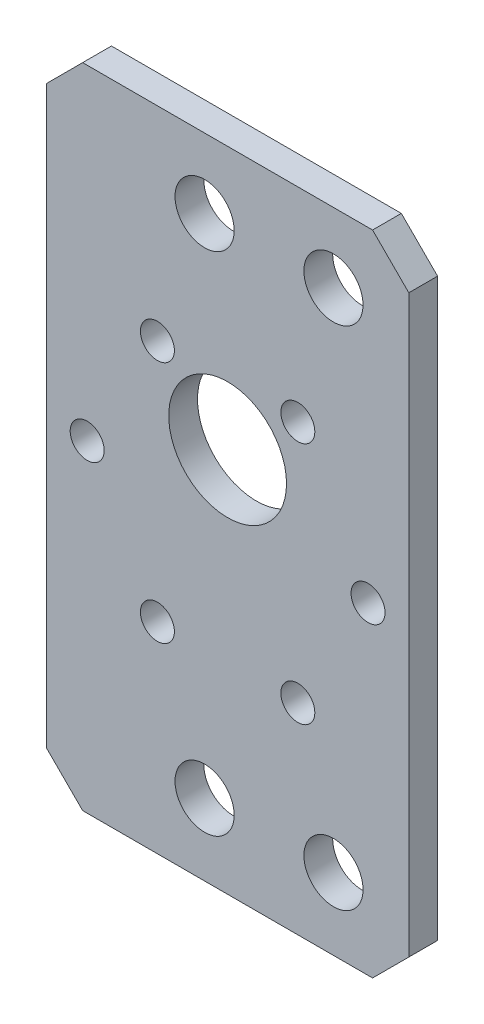
ISO-10303-21;
HEADER;
FILE_DESCRIPTION(('STEP AP214'),'2;1');
FILE_NAME('part.step','',(''),(''),'','','');
FILE_SCHEMA(('AUTOMOTIVE_DESIGN { 1 0 10303 214 1 1 1 1 }'));
ENDSEC;
DATA;
#1=APPLICATION_CONTEXT('core data for automotive mechanical design processes');
#2=APPLICATION_PROTOCOL_DEFINITION('international standard','automotive_design',2000,#1);
#3=PRODUCT_CONTEXT('',#1,'mechanical');
#4=PRODUCT('Part','Part','',(#3));
#5=PRODUCT_RELATED_PRODUCT_CATEGORY('part','',(#4));
#6=PRODUCT_DEFINITION_FORMATION('','',#4);
#7=PRODUCT_DEFINITION_CONTEXT('part definition',#1,'design');
#8=PRODUCT_DEFINITION('design','',#6,#7);
#9=PRODUCT_DEFINITION_SHAPE('','',#8);
#10=(LENGTH_UNIT() NAMED_UNIT(*) SI_UNIT(.MILLI.,.METRE.));
#11=(NAMED_UNIT(*) PLANE_ANGLE_UNIT() SI_UNIT($,.RADIAN.));
#12=(NAMED_UNIT(*) SI_UNIT($,.STERADIAN.) SOLID_ANGLE_UNIT());
#13=UNCERTAINTY_MEASURE_WITH_UNIT(LENGTH_MEASURE(1.E-05),#10,'distance_accuracy_value','');
#14=(GEOMETRIC_REPRESENTATION_CONTEXT(3) GLOBAL_UNCERTAINTY_ASSIGNED_CONTEXT((#13)) GLOBAL_UNIT_ASSIGNED_CONTEXT((#10,
#11,#12)) REPRESENTATION_CONTEXT('',''));
#15=CARTESIAN_POINT('',(0.,0.,0.));
#16=DIRECTION('',(0.,0.,1.));
#17=DIRECTION('',(1.,0.,0.));
#18=AXIS2_PLACEMENT_3D('',#15,#16,#17);
#19=CARTESIAN_POINT('',(0.,0.,3.175));
#20=DIRECTION('',(0.,0.,1.));
#21=DIRECTION('',(1.,0.,0.));
#22=AXIS2_PLACEMENT_3D('',#19,#20,#21);
#23=PLANE('',#22);
#24=CARTESIAN_POINT('',(11.684,21.2995800237138,3.175));
#25=DIRECTION('',(0.,0.,-1.));
#26=DIRECTION('',(-1.,0.,0.));
#27=AXIS2_PLACEMENT_3D('',#24,#25,#26);
#28=CIRCLE('',#27,3.2639);
#29=CARTESIAN_POINT('',(8.42010000000002,21.2995800237138,3.175));
#30=VERTEX_POINT('',#29);
#31=EDGE_CURVE('E243',#30,#30,#28,.T.);
#32=ORIENTED_EDGE('',*,*,#31,.T.);
#33=EDGE_LOOP('',(#32));
#34=FACE_BOUND('',#33,.T.);
#35=CARTESIAN_POINT('',(-2.53999999999998,21.2995800237138,3.175));
#36=DIRECTION('',(0.,0.,-1.));
#37=DIRECTION('',(-1.,0.,0.));
#38=AXIS2_PLACEMENT_3D('',#35,#36,#37);
#39=CIRCLE('',#38,3.2639);
#40=CARTESIAN_POINT('',(-5.80389999999998,21.2995800237138,3.175));
#41=VERTEX_POINT('',#40);
#42=EDGE_CURVE('E237',#41,#41,#39,.T.);
#43=ORIENTED_EDGE('',*,*,#42,.T.);
#44=EDGE_LOOP('',(#43));
#45=FACE_BOUND('',#44,.T.);
#46=CARTESIAN_POINT('',(11.684,-34.5804199762862,3.175));
#47=DIRECTION('',(0.,0.,-1.));
#48=DIRECTION('',(-1.,0.,0.));
#49=AXIS2_PLACEMENT_3D('',#46,#47,#48);
#50=CIRCLE('',#49,3.2639);
#51=CARTESIAN_POINT('',(8.42010000000002,-34.5804199762862,3.175));
#52=VERTEX_POINT('',#51);
#53=EDGE_CURVE('E231',#52,#52,#50,.T.);
#54=ORIENTED_EDGE('',*,*,#53,.T.);
#55=EDGE_LOOP('',(#54));
#56=FACE_BOUND('',#55,.T.);
#57=CARTESIAN_POINT('',(-2.53999999999998,-34.5804199762862,3.175));
#58=DIRECTION('',(0.,0.,-1.));
#59=DIRECTION('',(-1.,0.,0.));
#60=AXIS2_PLACEMENT_3D('',#57,#58,#59);
#61=CIRCLE('',#60,3.2639);
#62=CARTESIAN_POINT('',(-5.80389999999998,-34.5804199762862,3.175));
#63=VERTEX_POINT('',#62);
#64=EDGE_CURVE('E212',#63,#63,#61,.T.);
#65=ORIENTED_EDGE('',*,*,#64,.T.);
#66=EDGE_LOOP('',(#65));
#67=FACE_BOUND('',#66,.T.);
#68=CARTESIAN_POINT('',(-15.5,-6.89914345751771,3.175));
#69=DIRECTION('',(0.,0.,1.));
#70=DIRECTION('',(1.,0.,0.));
#71=AXIS2_PLACEMENT_3D('',#68,#69,#70);
#72=CIRCLE('',#71,1.875);
#73=CARTESIAN_POINT('',(-13.625,-6.89914345751771,3.175));
#74=VERTEX_POINT('',#73);
#75=EDGE_CURVE('E208',#74,#74,#72,.T.);
#76=ORIENTED_EDGE('',*,*,#75,.F.);
#77=EDGE_LOOP('',(#76));
#78=FACE_BOUND('',#77,.T.);
#79=CARTESIAN_POINT('',(-7.74999999999987,-20.3225372161766,3.175));
#80=DIRECTION('',(0.,0.,1.));
#81=DIRECTION('',(1.,0.,0.));
#82=AXIS2_PLACEMENT_3D('',#79,#80,#81);
#83=CIRCLE('',#82,1.875);
#84=CARTESIAN_POINT('',(-5.87499999999987,-20.3225372161766,3.175));
#85=VERTEX_POINT('',#84);
#86=EDGE_CURVE('E215',#85,#85,#83,.T.);
#87=ORIENTED_EDGE('',*,*,#86,.F.);
#88=EDGE_LOOP('',(#87));
#89=FACE_BOUND('',#88,.T.);
#90=CARTESIAN_POINT('',(7.75000000000016,-20.3225372161764,3.175));
#91=DIRECTION('',(0.,0.,1.));
#92=DIRECTION('',(1.,0.,0.));
#93=AXIS2_PLACEMENT_3D('',#90,#91,#92);
#94=CIRCLE('',#93,1.875);
#95=CARTESIAN_POINT('',(9.62500000000016,-20.3225372161764,3.175));
#96=VERTEX_POINT('',#95);
#97=EDGE_CURVE('E221',#96,#96,#94,.T.);
#98=ORIENTED_EDGE('',*,*,#97,.F.);
#99=EDGE_LOOP('',(#98));
#100=FACE_BOUND('',#99,.T.);
#101=CARTESIAN_POINT('',(15.5,-6.89914345751771,3.175));
#102=DIRECTION('',(0.,0.,1.));
#103=DIRECTION('',(1.,0.,0.));
#104=AXIS2_PLACEMENT_3D('',#101,#102,#103);
#105=CIRCLE('',#104,1.875);
#106=CARTESIAN_POINT('',(17.375,-6.89914345751771,3.175));
#107=VERTEX_POINT('',#106);
#108=EDGE_CURVE('E196',#107,#107,#105,.T.);
#109=ORIENTED_EDGE('',*,*,#108,.F.);
#110=EDGE_LOOP('',(#109));
#111=FACE_BOUND('',#110,.T.);
#112=CARTESIAN_POINT('',(7.74999999999997,6.52425030114109,3.175));
#113=DIRECTION('',(0.,0.,1.));
#114=DIRECTION('',(1.,0.,0.));
#115=AXIS2_PLACEMENT_3D('',#112,#113,#114);
#116=CIRCLE('',#115,1.875);
#117=CARTESIAN_POINT('',(9.62499999999996,6.52425030114109,3.175));
#118=VERTEX_POINT('',#117);
#119=EDGE_CURVE('E203',#118,#118,#116,.T.);
#120=ORIENTED_EDGE('',*,*,#119,.F.);
#121=EDGE_LOOP('',(#120));
#122=FACE_BOUND('',#121,.T.);
#123=CARTESIAN_POINT('',(-7.75000000000006,6.52425030114105,3.175));
#124=DIRECTION('',(0.,0.,1.));
#125=DIRECTION('',(1.,0.,0.));
#126=AXIS2_PLACEMENT_3D('',#123,#124,#125);
#127=CIRCLE('',#126,1.875);
#128=CARTESIAN_POINT('',(-5.87500000000006,6.52425030114105,3.175));
#129=VERTEX_POINT('',#128);
#130=EDGE_CURVE('E190',#129,#129,#127,.T.);
#131=ORIENTED_EDGE('',*,*,#130,.F.);
#132=EDGE_LOOP('',(#131));
#133=FACE_BOUND('',#132,.T.);
#134=DIRECTION('',(-1.,0.,0.));
#135=VECTOR('',#134,1.);
#136=CARTESIAN_POINT('',(-20.,29.,3.175));
#137=LINE('',#136,#135);
#138=CARTESIAN_POINT('',(16.,29.,3.175));
#139=VERTEX_POINT('',#138);
#140=CARTESIAN_POINT('',(-16.,29.,3.175));
#141=VERTEX_POINT('',#140);
#142=EDGE_CURVE('E140',#139,#141,#137,.T.);
#143=ORIENTED_EDGE('',*,*,#142,.T.);
#144=DIRECTION('',(0.707106781186549,0.707106781186546,0.));
#145=VECTOR('',#144,1.);
#146=CARTESIAN_POINT('',(-22.5,22.5,3.175));
#147=LINE('',#146,#145);
#148=CARTESIAN_POINT('',(-20.,25.,3.175));
#149=VERTEX_POINT('',#148);
#150=EDGE_CURVE('E158',#141,#149,#147,.F.);
#151=ORIENTED_EDGE('',*,*,#150,.T.);
#152=DIRECTION('',(0.,-1.,0.));
#153=VECTOR('',#152,1.);
#154=CARTESIAN_POINT('',(-20.,29.,3.175));
#155=LINE('',#154,#153);
#156=CARTESIAN_POINT('',(-20.,-38.5,3.175));
#157=VERTEX_POINT('',#156);
#158=EDGE_CURVE('E122',#149,#157,#155,.T.);
#159=ORIENTED_EDGE('',*,*,#158,.T.);
#160=DIRECTION('',(-0.707106781186546,0.707106781186549,0.));
#161=VECTOR('',#160,1.);
#162=CARTESIAN_POINT('',(-29.25,-29.2499999999999,3.175));
#163=LINE('',#162,#161);
#164=CARTESIAN_POINT('',(-16.,-42.5,3.175));
#165=VERTEX_POINT('',#164);
#166=EDGE_CURVE('E154',#157,#165,#163,.F.);
#167=ORIENTED_EDGE('',*,*,#166,.T.);
#168=DIRECTION('',(1.,0.,0.));
#169=VECTOR('',#168,1.);
#170=CARTESIAN_POINT('',(-20.,-42.5,3.175));
#171=LINE('',#170,#169);
#172=CARTESIAN_POINT('',(16.,-42.5,3.175));
#173=VERTEX_POINT('',#172);
#174=EDGE_CURVE('E167',#165,#173,#171,.T.);
#175=ORIENTED_EDGE('',*,*,#174,.T.);
#176=DIRECTION('',(-0.707106781186549,-0.707106781186546,0.));
#177=VECTOR('',#176,1.);
#178=CARTESIAN_POINT('',(29.25,-29.2500000000001,3.175));
#179=LINE('',#178,#177);
#180=CARTESIAN_POINT('',(20.,-38.5,3.175));
#181=VERTEX_POINT('',#180);
#182=EDGE_CURVE('E57',#173,#181,#179,.F.);
#183=ORIENTED_EDGE('',*,*,#182,.T.);
#184=DIRECTION('',(0.,1.,0.));
#185=VECTOR('',#184,1.);
#186=CARTESIAN_POINT('',(20.,29.,3.175));
#187=LINE('',#186,#185);
#188=CARTESIAN_POINT('',(20.,25.,3.175));
#189=VERTEX_POINT('',#188);
#190=EDGE_CURVE('E173',#181,#189,#187,.T.);
#191=ORIENTED_EDGE('',*,*,#190,.T.);
#192=DIRECTION('',(0.707106781186546,-0.707106781186549,0.));
#193=VECTOR('',#192,1.);
#194=CARTESIAN_POINT('',(22.5,22.4999999999999,3.175));
#195=LINE('',#194,#193);
#196=EDGE_CURVE('E156',#189,#139,#195,.F.);
#197=ORIENTED_EDGE('',*,*,#196,.T.);
#198=EDGE_LOOP('',(#143,#151,#159,#167,#175,#183,#191,#197));
#199=FACE_BOUND('',#198,.T.);
#200=CARTESIAN_POINT('',(0.,0.,3.175));
#201=DIRECTION('',(0.,0.,1.));
#202=DIRECTION('',(1.,0.,0.));
#203=AXIS2_PLACEMENT_3D('',#200,#201,#202);
#204=CIRCLE('',#203,6.5);
#205=CARTESIAN_POINT('',(6.5,0.,3.175));
#206=VERTEX_POINT('',#205);
#207=EDGE_CURVE('E131',#206,#206,#204,.T.);
#208=ORIENTED_EDGE('',*,*,#207,.F.);
#209=EDGE_LOOP('',(#208));
#210=FACE_BOUND('',#209,.T.);
#211=ADVANCED_FACE('F35',(#34,#45,#56,#67,#78,#89,#100,#111,#122,#133,#199,#210),#23,.T.);
#212=CARTESIAN_POINT('',(0.,0.,0.));
#213=DIRECTION('',(0.,0.,1.));
#214=DIRECTION('',(1.,0.,0.));
#215=AXIS2_PLACEMENT_3D('',#212,#213,#214);
#216=PLANE('',#215);
#217=CARTESIAN_POINT('',(11.684,21.2995800237138,0.));
#218=DIRECTION('',(0.,0.,-1.));
#219=DIRECTION('',(-1.,0.,0.));
#220=AXIS2_PLACEMENT_3D('',#217,#218,#219);
#221=CIRCLE('',#220,3.2639);
#222=CARTESIAN_POINT('',(8.42010000000002,21.2995800237138,0.));
#223=VERTEX_POINT('',#222);
#224=EDGE_CURVE('E246',#223,#223,#221,.T.);
#225=ORIENTED_EDGE('',*,*,#224,.F.);
#226=EDGE_LOOP('',(#225));
#227=FACE_BOUND('',#226,.T.);
#228=CARTESIAN_POINT('',(-2.53999999999998,21.2995800237138,0.));
#229=DIRECTION('',(0.,0.,-1.));
#230=DIRECTION('',(-1.,0.,0.));
#231=AXIS2_PLACEMENT_3D('',#228,#229,#230);
#232=CIRCLE('',#231,3.2639);
#233=CARTESIAN_POINT('',(-5.80389999999998,21.2995800237138,0.));
#234=VERTEX_POINT('',#233);
#235=EDGE_CURVE('E240',#234,#234,#232,.T.);
#236=ORIENTED_EDGE('',*,*,#235,.F.);
#237=EDGE_LOOP('',(#236));
#238=FACE_BOUND('',#237,.T.);
#239=CARTESIAN_POINT('',(11.684,-34.5804199762862,0.));
#240=DIRECTION('',(0.,0.,-1.));
#241=DIRECTION('',(-1.,0.,0.));
#242=AXIS2_PLACEMENT_3D('',#239,#240,#241);
#243=CIRCLE('',#242,3.2639);
#244=CARTESIAN_POINT('',(8.42010000000002,-34.5804199762862,0.));
#245=VERTEX_POINT('',#244);
#246=EDGE_CURVE('E234',#245,#245,#243,.T.);
#247=ORIENTED_EDGE('',*,*,#246,.F.);
#248=EDGE_LOOP('',(#247));
#249=FACE_BOUND('',#248,.T.);
#250=CARTESIAN_POINT('',(-2.53999999999998,-34.5804199762862,0.));
#251=DIRECTION('',(0.,0.,-1.));
#252=DIRECTION('',(-1.,0.,0.));
#253=AXIS2_PLACEMENT_3D('',#250,#251,#252);
#254=CIRCLE('',#253,3.2639);
#255=CARTESIAN_POINT('',(-5.80389999999998,-34.5804199762862,0.));
#256=VERTEX_POINT('',#255);
#257=EDGE_CURVE('E228',#256,#256,#254,.T.);
#258=ORIENTED_EDGE('',*,*,#257,.F.);
#259=EDGE_LOOP('',(#258));
#260=FACE_BOUND('',#259,.T.);
#261=CARTESIAN_POINT('',(-15.5,-6.89914345751771,0.));
#262=DIRECTION('',(0.,0.,1.));
#263=DIRECTION('',(1.,0.,0.));
#264=AXIS2_PLACEMENT_3D('',#261,#262,#263);
#265=CIRCLE('',#264,1.875);
#266=CARTESIAN_POINT('',(-13.625,-6.89914345751771,0.));
#267=VERTEX_POINT('',#266);
#268=EDGE_CURVE('E211',#267,#267,#265,.T.);
#269=ORIENTED_EDGE('',*,*,#268,.T.);
#270=EDGE_LOOP('',(#269));
#271=FACE_BOUND('',#270,.T.);
#272=CARTESIAN_POINT('',(-7.74999999999987,-20.3225372161766,0.));
#273=DIRECTION('',(0.,0.,1.));
#274=DIRECTION('',(1.,0.,0.));
#275=AXIS2_PLACEMENT_3D('',#272,#273,#274);
#276=CIRCLE('',#275,1.875);
#277=CARTESIAN_POINT('',(-5.87499999999987,-20.3225372161766,0.));
#278=VERTEX_POINT('',#277);
#279=EDGE_CURVE('E218',#278,#278,#276,.T.);
#280=ORIENTED_EDGE('',*,*,#279,.T.);
#281=EDGE_LOOP('',(#280));
#282=FACE_BOUND('',#281,.T.);
#283=CARTESIAN_POINT('',(7.75000000000016,-20.3225372161764,0.));
#284=DIRECTION('',(0.,0.,1.));
#285=DIRECTION('',(1.,0.,0.));
#286=AXIS2_PLACEMENT_3D('',#283,#284,#285);
#287=CIRCLE('',#286,1.875);
#288=CARTESIAN_POINT('',(9.62500000000016,-20.3225372161764,0.));
#289=VERTEX_POINT('',#288);
#290=EDGE_CURVE('E200',#289,#289,#287,.T.);
#291=ORIENTED_EDGE('',*,*,#290,.T.);
#292=EDGE_LOOP('',(#291));
#293=FACE_BOUND('',#292,.T.);
#294=CARTESIAN_POINT('',(15.5,-6.89914345751771,0.));
#295=DIRECTION('',(0.,0.,1.));
#296=DIRECTION('',(1.,0.,0.));
#297=AXIS2_PLACEMENT_3D('',#294,#295,#296);
#298=CIRCLE('',#297,1.875);
#299=CARTESIAN_POINT('',(17.375,-6.89914345751771,0.));
#300=VERTEX_POINT('',#299);
#301=EDGE_CURVE('E199',#300,#300,#298,.T.);
#302=ORIENTED_EDGE('',*,*,#301,.T.);
#303=EDGE_LOOP('',(#302));
#304=FACE_BOUND('',#303,.T.);
#305=CARTESIAN_POINT('',(7.74999999999997,6.52425030114109,0.));
#306=DIRECTION('',(0.,0.,1.));
#307=DIRECTION('',(1.,0.,0.));
#308=AXIS2_PLACEMENT_3D('',#305,#306,#307);
#309=CIRCLE('',#308,1.875);
#310=CARTESIAN_POINT('',(9.62499999999996,6.52425030114109,0.));
#311=VERTEX_POINT('',#310);
#312=EDGE_CURVE('E193',#311,#311,#309,.T.);
#313=ORIENTED_EDGE('',*,*,#312,.T.);
#314=EDGE_LOOP('',(#313));
#315=FACE_BOUND('',#314,.T.);
#316=CARTESIAN_POINT('',(-7.75000000000006,6.52425030114105,0.));
#317=DIRECTION('',(0.,0.,1.));
#318=DIRECTION('',(1.,0.,0.));
#319=AXIS2_PLACEMENT_3D('',#316,#317,#318);
#320=CIRCLE('',#319,1.875);
#321=CARTESIAN_POINT('',(-5.87500000000006,6.52425030114105,0.));
#322=VERTEX_POINT('',#321);
#323=EDGE_CURVE('E188',#322,#322,#320,.T.);
#324=ORIENTED_EDGE('',*,*,#323,.T.);
#325=EDGE_LOOP('',(#324));
#326=FACE_BOUND('',#325,.T.);
#327=DIRECTION('',(0.,-1.,0.));
#328=VECTOR('',#327,1.);
#329=CARTESIAN_POINT('',(-20.,29.,0.));
#330=LINE('',#329,#328);
#331=CARTESIAN_POINT('',(-20.,25.,0.));
#332=VERTEX_POINT('',#331);
#333=CARTESIAN_POINT('',(-20.,-38.5,0.));
#334=VERTEX_POINT('',#333);
#335=EDGE_CURVE('E119',#332,#334,#330,.T.);
#336=ORIENTED_EDGE('',*,*,#335,.F.);
#337=DIRECTION('',(-0.707106781186549,-0.707106781186546,0.));
#338=VECTOR('',#337,1.);
#339=CARTESIAN_POINT('',(-20.,25.,0.));
#340=LINE('',#339,#338);
#341=CARTESIAN_POINT('',(-16.,29.,0.));
#342=VERTEX_POINT('',#341);
#343=EDGE_CURVE('E102',#332,#342,#340,.F.);
#344=ORIENTED_EDGE('',*,*,#343,.T.);
#345=DIRECTION('',(-1.,0.,0.));
#346=VECTOR('',#345,1.);
#347=CARTESIAN_POINT('',(-20.,29.,0.));
#348=LINE('',#347,#346);
#349=CARTESIAN_POINT('',(16.,29.,0.));
#350=VERTEX_POINT('',#349);
#351=EDGE_CURVE('E144',#350,#342,#348,.T.);
#352=ORIENTED_EDGE('',*,*,#351,.F.);
#353=DIRECTION('',(-0.707106781186546,0.707106781186549,0.));
#354=VECTOR('',#353,1.);
#355=CARTESIAN_POINT('',(16.,29.,0.));
#356=LINE('',#355,#354);
#357=CARTESIAN_POINT('',(20.,25.,0.));
#358=VERTEX_POINT('',#357);
#359=EDGE_CURVE('E113',#350,#358,#356,.F.);
#360=ORIENTED_EDGE('',*,*,#359,.T.);
#361=DIRECTION('',(0.,1.,0.));
#362=VECTOR('',#361,1.);
#363=CARTESIAN_POINT('',(20.,29.,0.));
#364=LINE('',#363,#362);
#365=CARTESIAN_POINT('',(20.,-38.5,0.));
#366=VERTEX_POINT('',#365);
#367=EDGE_CURVE('E134',#366,#358,#364,.T.);
#368=ORIENTED_EDGE('',*,*,#367,.F.);
#369=DIRECTION('',(0.707106781186549,0.707106781186546,0.));
#370=VECTOR('',#369,1.);
#371=CARTESIAN_POINT('',(20.,-38.5,0.));
#372=LINE('',#371,#370);
#373=CARTESIAN_POINT('',(16.,-42.5,0.));
#374=VERTEX_POINT('',#373);
#375=EDGE_CURVE('E123',#366,#374,#372,.F.);
#376=ORIENTED_EDGE('',*,*,#375,.T.);
#377=DIRECTION('',(1.,0.,0.));
#378=VECTOR('',#377,1.);
#379=CARTESIAN_POINT('',(-20.,-42.5,0.));
#380=LINE('',#379,#378);
#381=CARTESIAN_POINT('',(-16.,-42.5,0.));
#382=VERTEX_POINT('',#381);
#383=EDGE_CURVE('E130',#382,#374,#380,.T.);
#384=ORIENTED_EDGE('',*,*,#383,.F.);
#385=DIRECTION('',(0.707106781186546,-0.707106781186549,0.));
#386=VECTOR('',#385,1.);
#387=CARTESIAN_POINT('',(-16.,-42.5,0.));
#388=LINE('',#387,#386);
#389=EDGE_CURVE('E129',#382,#334,#388,.F.);
#390=ORIENTED_EDGE('',*,*,#389,.T.);
#391=EDGE_LOOP('',(#336,#344,#352,#360,#368,#376,#384,#390));
#392=FACE_BOUND('',#391,.T.);
#393=CARTESIAN_POINT('',(0.,0.,0.));
#394=DIRECTION('',(0.,0.,1.));
#395=DIRECTION('',(1.,0.,0.));
#396=AXIS2_PLACEMENT_3D('',#393,#394,#395);
#397=CIRCLE('',#396,6.5);
#398=CARTESIAN_POINT('',(6.5,0.,0.));
#399=VERTEX_POINT('',#398);
#400=EDGE_CURVE('E137',#399,#399,#397,.T.);
#401=ORIENTED_EDGE('',*,*,#400,.T.);
#402=EDGE_LOOP('',(#401));
#403=FACE_BOUND('',#402,.T.);
#404=ADVANCED_FACE('F126',(#227,#238,#249,#260,#271,#282,#293,#304,#315,#326,#392,#403),#216,.F.);
#405=CARTESIAN_POINT('',(-20.,29.,3.175));
#406=DIRECTION('',(1.,0.,0.));
#407=DIRECTION('',(0.,1.,0.));
#408=AXIS2_PLACEMENT_3D('',#405,#406,#407);
#409=PLANE('',#408);
#410=ORIENTED_EDGE('',*,*,#158,.F.);
#411=DIRECTION('',(0.,0.,-1.));
#412=VECTOR('',#411,1.);
#413=CARTESIAN_POINT('',(-20.,25.,3.175));
#414=LINE('',#413,#412);
#415=EDGE_CURVE('E106',#149,#332,#414,.T.);
#416=ORIENTED_EDGE('',*,*,#415,.T.);
#417=ORIENTED_EDGE('',*,*,#335,.T.);
#418=DIRECTION('',(0.,0.,1.));
#419=VECTOR('',#418,1.);
#420=CARTESIAN_POINT('',(-20.,-38.5,3.175));
#421=LINE('',#420,#419);
#422=EDGE_CURVE('E124',#334,#157,#421,.T.);
#423=ORIENTED_EDGE('',*,*,#422,.T.);
#424=EDGE_LOOP('',(#410,#416,#417,#423));
#425=FACE_BOUND('',#424,.T.);
#426=ADVANCED_FACE('F118',(#425),#409,.F.);
#427=CARTESIAN_POINT('',(-20.,-42.5,3.175));
#428=DIRECTION('',(0.,1.,0.));
#429=DIRECTION('',(0.,0.,1.));
#430=AXIS2_PLACEMENT_3D('',#427,#428,#429);
#431=PLANE('',#430);
#432=ORIENTED_EDGE('',*,*,#174,.F.);
#433=DIRECTION('',(0.,0.,-1.));
#434=VECTOR('',#433,1.);
#435=CARTESIAN_POINT('',(-16.,-42.5,3.175));
#436=LINE('',#435,#434);
#437=EDGE_CURVE('E11',#165,#382,#436,.T.);
#438=ORIENTED_EDGE('',*,*,#437,.T.);
#439=ORIENTED_EDGE('',*,*,#383,.T.);
#440=DIRECTION('',(0.,0.,1.));
#441=VECTOR('',#440,1.);
#442=CARTESIAN_POINT('',(16.,-42.5,3.175));
#443=LINE('',#442,#441);
#444=EDGE_CURVE('E43',#374,#173,#443,.T.);
#445=ORIENTED_EDGE('',*,*,#444,.T.);
#446=EDGE_LOOP('',(#432,#438,#439,#445));
#447=FACE_BOUND('',#446,.T.);
#448=ADVANCED_FACE('F166',(#447),#431,.F.);
#449=CARTESIAN_POINT('',(20.,29.,3.175));
#450=DIRECTION('',(-1.,0.,0.));
#451=DIRECTION('',(0.,-1.,0.));
#452=AXIS2_PLACEMENT_3D('',#449,#450,#451);
#453=PLANE('',#452);
#454=ORIENTED_EDGE('',*,*,#367,.T.);
#455=DIRECTION('',(0.,0.,1.));
#456=VECTOR('',#455,1.);
#457=CARTESIAN_POINT('',(20.,25.,3.175));
#458=LINE('',#457,#456);
#459=EDGE_CURVE('E50',#358,#189,#458,.T.);
#460=ORIENTED_EDGE('',*,*,#459,.T.);
#461=ORIENTED_EDGE('',*,*,#190,.F.);
#462=DIRECTION('',(0.,0.,-1.));
#463=VECTOR('',#462,1.);
#464=CARTESIAN_POINT('',(20.,-38.5,3.175));
#465=LINE('',#464,#463);
#466=EDGE_CURVE('E160',#181,#366,#465,.T.);
#467=ORIENTED_EDGE('',*,*,#466,.T.);
#468=EDGE_LOOP('',(#454,#460,#461,#467));
#469=FACE_BOUND('',#468,.T.);
#470=ADVANCED_FACE('F177',(#469),#453,.F.);
#471=CARTESIAN_POINT('',(-20.,29.,3.175));
#472=DIRECTION('',(0.,-1.,0.));
#473=DIRECTION('',(0.,0.,-1.));
#474=AXIS2_PLACEMENT_3D('',#471,#472,#473);
#475=PLANE('',#474);
#476=ORIENTED_EDGE('',*,*,#351,.T.);
#477=DIRECTION('',(0.,0.,1.));
#478=VECTOR('',#477,1.);
#479=CARTESIAN_POINT('',(-16.,29.,3.175));
#480=LINE('',#479,#478);
#481=EDGE_CURVE('E107',#342,#141,#480,.T.);
#482=ORIENTED_EDGE('',*,*,#481,.T.);
#483=ORIENTED_EDGE('',*,*,#142,.F.);
#484=DIRECTION('',(0.,0.,-1.));
#485=VECTOR('',#484,1.);
#486=CARTESIAN_POINT('',(16.,29.,3.175));
#487=LINE('',#486,#485);
#488=EDGE_CURVE('E112',#139,#350,#487,.T.);
#489=ORIENTED_EDGE('',*,*,#488,.T.);
#490=EDGE_LOOP('',(#476,#482,#483,#489));
#491=FACE_BOUND('',#490,.T.);
#492=ADVANCED_FACE('F184',(#491),#475,.F.);
#493=CARTESIAN_POINT('',(0.,0.,3.175));
#494=DIRECTION('',(0.,0.,-1.));
#495=DIRECTION('',(-1.,0.,0.));
#496=AXIS2_PLACEMENT_3D('',#493,#494,#495);
#497=CYLINDRICAL_SURFACE('',#496,6.5);
#498=ORIENTED_EDGE('',*,*,#207,.T.);
#499=EDGE_LOOP('',(#498));
#500=FACE_BOUND('',#499,.T.);
#501=ORIENTED_EDGE('',*,*,#400,.F.);
#502=EDGE_LOOP('',(#501));
#503=FACE_BOUND('',#502,.T.);
#504=ADVANCED_FACE('F287',(#500,#503),#497,.F.);
#505=CARTESIAN_POINT('',(-20.,25.,3.175));
#506=DIRECTION('',(0.707106781186546,-0.707106781186549,0.));
#507=DIRECTION('',(0.,0.,-1.));
#508=AXIS2_PLACEMENT_3D('',#505,#506,#507);
#509=PLANE('',#508);
#510=ORIENTED_EDGE('',*,*,#150,.F.);
#511=ORIENTED_EDGE('',*,*,#481,.F.);
#512=ORIENTED_EDGE('',*,*,#343,.F.);
#513=ORIENTED_EDGE('',*,*,#415,.F.);
#514=EDGE_LOOP('',(#510,#511,#512,#513));
#515=FACE_BOUND('',#514,.T.);
#516=ADVANCED_FACE('F105',(#515),#509,.F.);
#517=CARTESIAN_POINT('',(16.,29.,3.175));
#518=DIRECTION('',(-0.707106781186549,-0.707106781186546,0.));
#519=DIRECTION('',(0.,0.,-1.));
#520=AXIS2_PLACEMENT_3D('',#517,#518,#519);
#521=PLANE('',#520);
#522=ORIENTED_EDGE('',*,*,#196,.F.);
#523=ORIENTED_EDGE('',*,*,#459,.F.);
#524=ORIENTED_EDGE('',*,*,#359,.F.);
#525=ORIENTED_EDGE('',*,*,#488,.F.);
#526=EDGE_LOOP('',(#522,#523,#524,#525));
#527=FACE_BOUND('',#526,.T.);
#528=ADVANCED_FACE('F181',(#527),#521,.F.);
#529=CARTESIAN_POINT('',(-16.,-42.5,3.175));
#530=DIRECTION('',(0.707106781186549,0.707106781186546,0.));
#531=DIRECTION('',(0.,0.,-1.));
#532=AXIS2_PLACEMENT_3D('',#529,#530,#531);
#533=PLANE('',#532);
#534=ORIENTED_EDGE('',*,*,#166,.F.);
#535=ORIENTED_EDGE('',*,*,#422,.F.);
#536=ORIENTED_EDGE('',*,*,#389,.F.);
#537=ORIENTED_EDGE('',*,*,#437,.F.);
#538=EDGE_LOOP('',(#534,#535,#536,#537));
#539=FACE_BOUND('',#538,.T.);
#540=ADVANCED_FACE('F300',(#539),#533,.F.);
#541=CARTESIAN_POINT('',(20.,-38.5,3.175));
#542=DIRECTION('',(-0.707106781186546,0.707106781186549,0.));
#543=DIRECTION('',(0.,0.,-1.));
#544=AXIS2_PLACEMENT_3D('',#541,#542,#543);
#545=PLANE('',#544);
#546=ORIENTED_EDGE('',*,*,#182,.F.);
#547=ORIENTED_EDGE('',*,*,#444,.F.);
#548=ORIENTED_EDGE('',*,*,#375,.F.);
#549=ORIENTED_EDGE('',*,*,#466,.F.);
#550=EDGE_LOOP('',(#546,#547,#548,#549));
#551=FACE_BOUND('',#550,.T.);
#552=ADVANCED_FACE('F37',(#551),#545,.F.);
#553=CARTESIAN_POINT('',(-7.75000000000006,6.52425030114105,0.));
#554=DIRECTION('',(0.,0.,1.));
#555=DIRECTION('',(1.,0.,0.));
#556=AXIS2_PLACEMENT_3D('',#553,#554,#555);
#557=CYLINDRICAL_SURFACE('',#556,1.875);
#558=ORIENTED_EDGE('',*,*,#323,.F.);
#559=EDGE_LOOP('',(#558));
#560=FACE_BOUND('',#559,.T.);
#561=ORIENTED_EDGE('',*,*,#130,.T.);
#562=EDGE_LOOP('',(#561));
#563=FACE_BOUND('',#562,.T.);
#564=ADVANCED_FACE('F273',(#560,#563),#557,.F.);
#565=CARTESIAN_POINT('',(7.74999999999997,6.52425030114109,0.));
#566=DIRECTION('',(0.,0.,1.));
#567=DIRECTION('',(1.,0.,0.));
#568=AXIS2_PLACEMENT_3D('',#565,#566,#567);
#569=CYLINDRICAL_SURFACE('',#568,1.875);
#570=ORIENTED_EDGE('',*,*,#312,.F.);
#571=EDGE_LOOP('',(#570));
#572=FACE_BOUND('',#571,.T.);
#573=ORIENTED_EDGE('',*,*,#119,.T.);
#574=EDGE_LOOP('',(#573));
#575=FACE_BOUND('',#574,.T.);
#576=ADVANCED_FACE('F276',(#572,#575),#569,.F.);
#577=CARTESIAN_POINT('',(15.5,-6.89914345751771,0.));
#578=DIRECTION('',(0.,0.,1.));
#579=DIRECTION('',(1.,0.,0.));
#580=AXIS2_PLACEMENT_3D('',#577,#578,#579);
#581=CYLINDRICAL_SURFACE('',#580,1.875);
#582=ORIENTED_EDGE('',*,*,#301,.F.);
#583=EDGE_LOOP('',(#582));
#584=FACE_BOUND('',#583,.T.);
#585=ORIENTED_EDGE('',*,*,#108,.T.);
#586=EDGE_LOOP('',(#585));
#587=FACE_BOUND('',#586,.T.);
#588=ADVANCED_FACE('F318',(#584,#587),#581,.F.);
#589=CARTESIAN_POINT('',(7.75000000000016,-20.3225372161764,0.));
#590=DIRECTION('',(0.,0.,1.));
#591=DIRECTION('',(1.,0.,0.));
#592=AXIS2_PLACEMENT_3D('',#589,#590,#591);
#593=CYLINDRICAL_SURFACE('',#592,1.875);
#594=ORIENTED_EDGE('',*,*,#290,.F.);
#595=EDGE_LOOP('',(#594));
#596=FACE_BOUND('',#595,.T.);
#597=ORIENTED_EDGE('',*,*,#97,.T.);
#598=EDGE_LOOP('',(#597));
#599=FACE_BOUND('',#598,.T.);
#600=ADVANCED_FACE('F326',(#596,#599),#593,.F.);
#601=CARTESIAN_POINT('',(-7.74999999999987,-20.3225372161766,0.));
#602=DIRECTION('',(0.,0.,1.));
#603=DIRECTION('',(1.,0.,0.));
#604=AXIS2_PLACEMENT_3D('',#601,#602,#603);
#605=CYLINDRICAL_SURFACE('',#604,1.875);
#606=ORIENTED_EDGE('',*,*,#279,.F.);
#607=EDGE_LOOP('',(#606));
#608=FACE_BOUND('',#607,.T.);
#609=ORIENTED_EDGE('',*,*,#86,.T.);
#610=EDGE_LOOP('',(#609));
#611=FACE_BOUND('',#610,.T.);
#612=ADVANCED_FACE('F334',(#608,#611),#605,.F.);
#613=CARTESIAN_POINT('',(-15.5,-6.89914345751771,0.));
#614=DIRECTION('',(0.,0.,1.));
#615=DIRECTION('',(1.,0.,0.));
#616=AXIS2_PLACEMENT_3D('',#613,#614,#615);
#617=CYLINDRICAL_SURFACE('',#616,1.875);
#618=ORIENTED_EDGE('',*,*,#268,.F.);
#619=EDGE_LOOP('',(#618));
#620=FACE_BOUND('',#619,.T.);
#621=ORIENTED_EDGE('',*,*,#75,.T.);
#622=EDGE_LOOP('',(#621));
#623=FACE_BOUND('',#622,.T.);
#624=ADVANCED_FACE('F342',(#620,#623),#617,.F.);
#625=CARTESIAN_POINT('',(-2.53999999999998,-34.5804199762862,0.));
#626=DIRECTION('',(0.,0.,-1.));
#627=DIRECTION('',(-1.,0.,0.));
#628=AXIS2_PLACEMENT_3D('',#625,#626,#627);
#629=CYLINDRICAL_SURFACE('',#628,3.2639);
#630=ORIENTED_EDGE('',*,*,#64,.F.);
#631=EDGE_LOOP('',(#630));
#632=FACE_BOUND('',#631,.T.);
#633=ORIENTED_EDGE('',*,*,#257,.T.);
#634=EDGE_LOOP('',(#633));
#635=FACE_BOUND('',#634,.T.);
#636=ADVANCED_FACE('F350',(#632,#635),#629,.F.);
#637=CARTESIAN_POINT('',(11.684,-34.5804199762862,0.));
#638=DIRECTION('',(0.,0.,-1.));
#639=DIRECTION('',(-1.,0.,0.));
#640=AXIS2_PLACEMENT_3D('',#637,#638,#639);
#641=CYLINDRICAL_SURFACE('',#640,3.2639);
#642=ORIENTED_EDGE('',*,*,#53,.F.);
#643=EDGE_LOOP('',(#642));
#644=FACE_BOUND('',#643,.T.);
#645=ORIENTED_EDGE('',*,*,#246,.T.);
#646=EDGE_LOOP('',(#645));
#647=FACE_BOUND('',#646,.T.);
#648=ADVANCED_FACE('F359',(#644,#647),#641,.F.);
#649=CARTESIAN_POINT('',(-2.53999999999998,21.2995800237138,0.));
#650=DIRECTION('',(0.,0.,-1.));
#651=DIRECTION('',(-1.,0.,0.));
#652=AXIS2_PLACEMENT_3D('',#649,#650,#651);
#653=CYLINDRICAL_SURFACE('',#652,3.2639);
#654=ORIENTED_EDGE('',*,*,#42,.F.);
#655=EDGE_LOOP('',(#654));
#656=FACE_BOUND('',#655,.T.);
#657=ORIENTED_EDGE('',*,*,#235,.T.);
#658=EDGE_LOOP('',(#657));
#659=FACE_BOUND('',#658,.T.);
#660=ADVANCED_FACE('F369',(#656,#659),#653,.F.);
#661=CARTESIAN_POINT('',(11.684,21.2995800237138,0.));
#662=DIRECTION('',(0.,0.,-1.));
#663=DIRECTION('',(-1.,0.,0.));
#664=AXIS2_PLACEMENT_3D('',#661,#662,#663);
#665=CYLINDRICAL_SURFACE('',#664,3.2639);
#666=ORIENTED_EDGE('',*,*,#31,.F.);
#667=EDGE_LOOP('',(#666));
#668=FACE_BOUND('',#667,.T.);
#669=ORIENTED_EDGE('',*,*,#224,.T.);
#670=EDGE_LOOP('',(#669));
#671=FACE_BOUND('',#670,.T.);
#672=ADVANCED_FACE('F250',(#668,#671),#665,.F.);
#673=CLOSED_SHELL('',(#211,#404,#426,#448,#470,#492,#504,#516,#528,#540,#552,#564,#576,#588,
#600,#612,#624,#636,#648,#660,#672));
#674=MANIFOLD_SOLID_BREP('B2',#673);
#675=ADVANCED_BREP_SHAPE_REPRESENTATION('',(#18,#674),#14);
#676=SHAPE_DEFINITION_REPRESENTATION(#9,#675);
ENDSEC;
END-ISO-10303-21;
